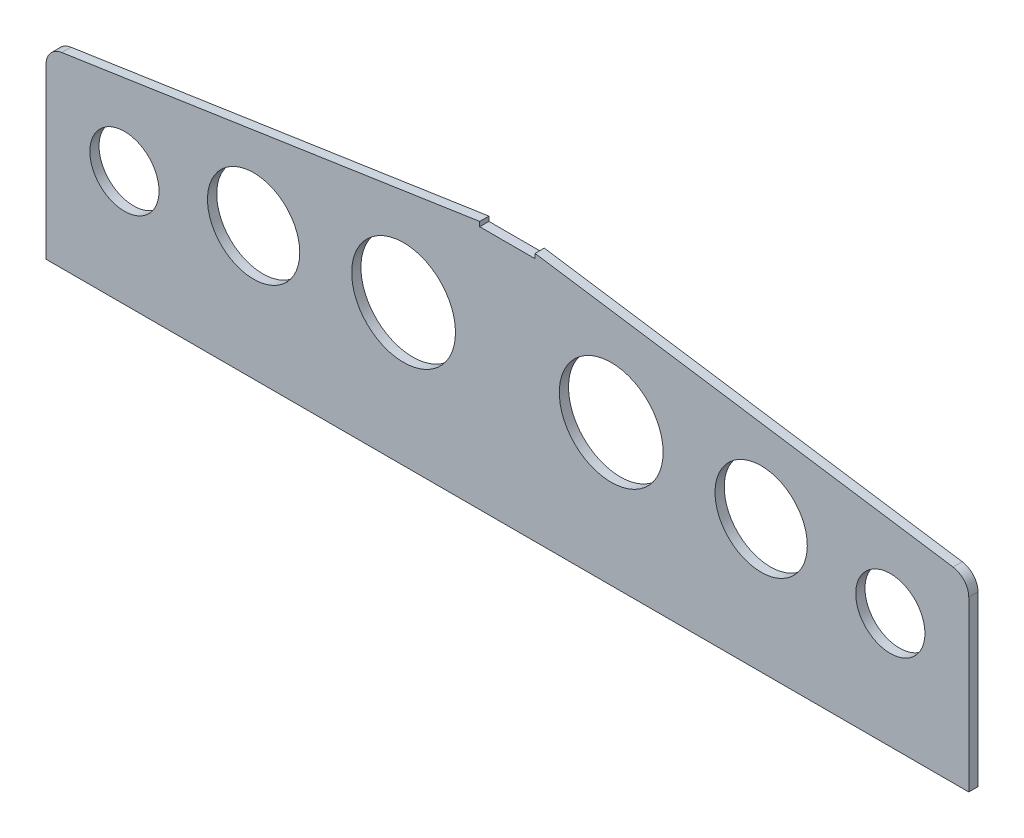
ISO-10303-21;
HEADER;
FILE_DESCRIPTION(('STEP AP214'),'2;1');
FILE_NAME('part.step','',(''),(''),'','','');
FILE_SCHEMA(('AUTOMOTIVE_DESIGN { 1 0 10303 214 1 1 1 1 }'));
ENDSEC;
DATA;
#1=APPLICATION_CONTEXT('core data for automotive mechanical design processes');
#2=APPLICATION_PROTOCOL_DEFINITION('international standard','automotive_design',2000,#1);
#3=PRODUCT_CONTEXT('',#1,'mechanical');
#4=PRODUCT('Part','Part','',(#3));
#5=PRODUCT_RELATED_PRODUCT_CATEGORY('part','',(#4));
#6=PRODUCT_DEFINITION_FORMATION('','',#4);
#7=PRODUCT_DEFINITION_CONTEXT('part definition',#1,'design');
#8=PRODUCT_DEFINITION('design','',#6,#7);
#9=PRODUCT_DEFINITION_SHAPE('','',#8);
#10=(LENGTH_UNIT() NAMED_UNIT(*) SI_UNIT(.MILLI.,.METRE.));
#11=(NAMED_UNIT(*) PLANE_ANGLE_UNIT() SI_UNIT($,.RADIAN.));
#12=(NAMED_UNIT(*) SI_UNIT($,.STERADIAN.) SOLID_ANGLE_UNIT());
#13=UNCERTAINTY_MEASURE_WITH_UNIT(LENGTH_MEASURE(1.E-05),#10,'distance_accuracy_value','');
#14=(GEOMETRIC_REPRESENTATION_CONTEXT(3) GLOBAL_UNCERTAINTY_ASSIGNED_CONTEXT((#13)) GLOBAL_UNIT_ASSIGNED_CONTEXT((#10,
#11,#12)) REPRESENTATION_CONTEXT('',''));
#15=CARTESIAN_POINT('',(0.,0.,0.));
#16=DIRECTION('',(0.,0.,1.));
#17=DIRECTION('',(1.,0.,0.));
#18=AXIS2_PLACEMENT_3D('',#15,#16,#17);
#19=CARTESIAN_POINT('',(-307.638914212905,504.066678813334,4.));
#20=DIRECTION('',(0.,0.,1.));
#21=DIRECTION('',(1.,0.,0.));
#22=AXIS2_PLACEMENT_3D('',#19,#20,#21);
#23=PLANE('',#22);
#24=CARTESIAN_POINT('',(-225.638914212905,488.456178179796,4.));
#25=DIRECTION('',(0.,0.,1.));
#26=DIRECTION('',(1.,0.,0.));
#27=AXIS2_PLACEMENT_3D('',#24,#25,#26);
#28=CIRCLE('',#27,20.);
#29=CARTESIAN_POINT('',(-205.638914212905,488.456178179796,4.));
#30=VERTEX_POINT('',#29);
#31=EDGE_CURVE('E232',#30,#30,#28,.T.);
#32=ORIENTED_EDGE('',*,*,#31,.F.);
#33=EDGE_LOOP('',(#32));
#34=FACE_BOUND('',#33,.T.);
#35=CARTESIAN_POINT('',(-70.6389142129046,492.206178179796,4.));
#36=DIRECTION('',(0.,0.,1.));
#37=DIRECTION('',(1.,0.,0.));
#38=AXIS2_PLACEMENT_3D('',#35,#36,#37);
#39=CIRCLE('',#38,22.5);
#40=CARTESIAN_POINT('',(-48.1389142129046,492.206178179796,4.));
#41=VERTEX_POINT('',#40);
#42=EDGE_CURVE('E220',#41,#41,#39,.T.);
#43=ORIENTED_EDGE('',*,*,#42,.F.);
#44=EDGE_LOOP('',(#43));
#45=FACE_BOUND('',#44,.T.);
#46=CARTESIAN_POINT('',(50.3610857870954,480.956178179796,4.));
#47=DIRECTION('',(0.,0.,1.));
#48=DIRECTION('',(1.,0.,0.));
#49=AXIS2_PLACEMENT_3D('',#46,#47,#48);
#50=CIRCLE('',#49,15.);
#51=CARTESIAN_POINT('',(65.3610857870954,480.956178179796,4.));
#52=VERTEX_POINT('',#51);
#53=EDGE_CURVE('E148',#52,#52,#50,.T.);
#54=ORIENTED_EDGE('',*,*,#53,.F.);
#55=EDGE_LOOP('',(#54));
#56=FACE_BOUND('',#55,.T.);
#57=CARTESIAN_POINT('',(-307.638914212905,504.066678813334,4.));
#58=DIRECTION('',(0.,0.,1.));
#59=DIRECTION('',(1.,0.,0.));
#60=AXIS2_PLACEMENT_3D('',#57,#58,#59);
#61=CIRCLE('',#60,8.00000000000002);
#62=CARTESIAN_POINT('',(-308.825637836347,511.97816963628,4.));
#63=VERTEX_POINT('',#62);
#64=CARTESIAN_POINT('',(-315.638914212905,504.066678813334,4.));
#65=VERTEX_POINT('',#64);
#66=EDGE_CURVE('E163',#63,#65,#61,.T.);
#67=ORIENTED_EDGE('',*,*,#66,.T.);
#68=DIRECTION('',(0.,-1.,0.));
#69=VECTOR('',#68,1.);
#70=CARTESIAN_POINT('',(-315.638914212905,504.066678813334,4.));
#71=LINE('',#70,#69);
#72=CARTESIAN_POINT('',(-315.638914212905,430.956178179796,4.));
#73=VERTEX_POINT('',#72);
#74=EDGE_CURVE('E101',#65,#73,#71,.T.);
#75=ORIENTED_EDGE('',*,*,#74,.T.);
#76=DIRECTION('',(1.,0.,0.));
#77=VECTOR('',#76,1.);
#78=CARTESIAN_POINT('',(-315.638914212905,430.956178179796,4.));
#79=LINE('',#78,#77);
#80=CARTESIAN_POINT('',(84.3610857870955,430.956178179796,4.));
#81=VERTEX_POINT('',#80);
#82=EDGE_CURVE('E184',#73,#81,#79,.T.);
#83=ORIENTED_EDGE('',*,*,#82,.T.);
#84=DIRECTION('',(0.,1.,0.));
#85=VECTOR('',#84,1.);
#86=CARTESIAN_POINT('',(84.3610857870954,504.066678813334,4.));
#87=LINE('',#86,#85);
#88=CARTESIAN_POINT('',(84.3610857870954,504.066678813334,4.));
#89=VERTEX_POINT('',#88);
#90=EDGE_CURVE('E203',#81,#89,#87,.T.);
#91=ORIENTED_EDGE('',*,*,#90,.T.);
#92=CARTESIAN_POINT('',(76.3610857870954,504.066678813334,4.));
#93=DIRECTION('',(0.,0.,1.));
#94=DIRECTION('',(1.,0.,0.));
#95=AXIS2_PLACEMENT_3D('',#92,#93,#94);
#96=CIRCLE('',#95,8.00000000000001);
#97=CARTESIAN_POINT('',(77.5478094105374,511.97816963628,4.));
#98=VERTEX_POINT('',#97);
#99=EDGE_CURVE('E200',#89,#98,#96,.T.);
#100=ORIENTED_EDGE('',*,*,#99,.T.);
#101=DIRECTION('',(-0.988936352868298,0.148340452930244,0.));
#102=VECTOR('',#101,1.);
#103=CARTESIAN_POINT('',(-103.638914212905,539.156178179796,4.));
#104=LINE('',#103,#102);
#105=CARTESIAN_POINT('',(-103.638914212905,539.156178179796,4.));
#106=VERTEX_POINT('',#105);
#107=EDGE_CURVE('E202',#98,#106,#104,.T.);
#108=ORIENTED_EDGE('',*,*,#107,.T.);
#109=DIRECTION('',(0.,-1.,0.));
#110=VECTOR('',#109,1.);
#111=CARTESIAN_POINT('',(-103.638914212905,539.156178179796,4.));
#112=LINE('',#111,#110);
#113=CARTESIAN_POINT('',(-103.638914212905,537.156178179796,4.));
#114=VERTEX_POINT('',#113);
#115=EDGE_CURVE('E126',#106,#114,#112,.T.);
#116=ORIENTED_EDGE('',*,*,#115,.T.);
#117=DIRECTION('',(-1.,0.,0.));
#118=VECTOR('',#117,1.);
#119=CARTESIAN_POINT('',(-127.638914212905,537.156178179796,4.));
#120=LINE('',#119,#118);
#121=CARTESIAN_POINT('',(-127.638914212905,537.156178179796,4.));
#122=VERTEX_POINT('',#121);
#123=EDGE_CURVE('E120',#114,#122,#120,.T.);
#124=ORIENTED_EDGE('',*,*,#123,.T.);
#125=DIRECTION('',(0.,1.,0.));
#126=VECTOR('',#125,1.);
#127=CARTESIAN_POINT('',(-127.638914212905,539.156178179796,4.));
#128=LINE('',#127,#126);
#129=CARTESIAN_POINT('',(-127.638914212905,539.156178179796,4.));
#130=VERTEX_POINT('',#129);
#131=EDGE_CURVE('E124',#122,#130,#128,.T.);
#132=ORIENTED_EDGE('',*,*,#131,.T.);
#133=DIRECTION('',(-0.988936352868298,-0.148340452930244,0.));
#134=VECTOR('',#133,1.);
#135=CARTESIAN_POINT('',(-127.638914212905,539.156178179796,4.));
#136=LINE('',#135,#134);
#137=EDGE_CURVE('E52',#130,#63,#136,.T.);
#138=ORIENTED_EDGE('',*,*,#137,.T.);
#139=EDGE_LOOP('',(#67,#75,#83,#91,#100,#108,#116,#124,#132,#138));
#140=FACE_BOUND('',#139,.T.);
#141=CARTESIAN_POINT('',(-5.63891421290464,488.456178179796,4.));
#142=DIRECTION('',(0.,0.,1.));
#143=DIRECTION('',(1.,0.,0.));
#144=AXIS2_PLACEMENT_3D('',#141,#142,#143);
#145=CIRCLE('',#144,20.);
#146=CARTESIAN_POINT('',(14.3610857870954,488.456178179796,4.));
#147=VERTEX_POINT('',#146);
#148=EDGE_CURVE('E214',#147,#147,#145,.T.);
#149=ORIENTED_EDGE('',*,*,#148,.F.);
#150=EDGE_LOOP('',(#149));
#151=FACE_BOUND('',#150,.T.);
#152=CARTESIAN_POINT('',(-281.638914212905,480.956178179796,4.));
#153=DIRECTION('',(0.,0.,1.));
#154=DIRECTION('',(1.,0.,0.));
#155=AXIS2_PLACEMENT_3D('',#152,#153,#154);
#156=CIRCLE('',#155,15.);
#157=CARTESIAN_POINT('',(-266.638914212905,480.956178179796,4.));
#158=VERTEX_POINT('',#157);
#159=EDGE_CURVE('E226',#158,#158,#156,.T.);
#160=ORIENTED_EDGE('',*,*,#159,.F.);
#161=EDGE_LOOP('',(#160));
#162=FACE_BOUND('',#161,.T.);
#163=CARTESIAN_POINT('',(-160.638914212905,492.206178179796,4.));
#164=DIRECTION('',(0.,0.,1.));
#165=DIRECTION('',(1.,0.,0.));
#166=AXIS2_PLACEMENT_3D('',#163,#164,#165);
#167=CIRCLE('',#166,22.5);
#168=CARTESIAN_POINT('',(-138.138914212905,492.206178179796,4.));
#169=VERTEX_POINT('',#168);
#170=EDGE_CURVE('E238',#169,#169,#167,.T.);
#171=ORIENTED_EDGE('',*,*,#170,.F.);
#172=EDGE_LOOP('',(#171));
#173=FACE_BOUND('',#172,.T.);
#174=ADVANCED_FACE('F35',(#34,#45,#56,#140,#151,#162,#173),#23,.T.);
#175=CARTESIAN_POINT('',(-307.638914212905,504.066678813334,0.));
#176=DIRECTION('',(0.,0.,1.));
#177=DIRECTION('',(1.,0.,0.));
#178=AXIS2_PLACEMENT_3D('',#175,#176,#177);
#179=PLANE('',#178);
#180=CARTESIAN_POINT('',(-307.638914212905,504.066678813334,0.));
#181=DIRECTION('',(0.,0.,1.));
#182=DIRECTION('',(1.,0.,0.));
#183=AXIS2_PLACEMENT_3D('',#180,#181,#182);
#184=CIRCLE('',#183,8.00000000000002);
#185=CARTESIAN_POINT('',(-308.825637836347,511.97816963628,0.));
#186=VERTEX_POINT('',#185);
#187=CARTESIAN_POINT('',(-315.638914212905,504.066678813334,0.));
#188=VERTEX_POINT('',#187);
#189=EDGE_CURVE('E144',#186,#188,#184,.T.);
#190=ORIENTED_EDGE('',*,*,#189,.F.);
#191=DIRECTION('',(-0.988936352868298,-0.148340452930244,0.));
#192=VECTOR('',#191,1.);
#193=CARTESIAN_POINT('',(-127.638914212905,539.156178179796,0.));
#194=LINE('',#193,#192);
#195=CARTESIAN_POINT('',(-127.638914212905,539.156178179796,0.));
#196=VERTEX_POINT('',#195);
#197=EDGE_CURVE('E93',#196,#186,#194,.T.);
#198=ORIENTED_EDGE('',*,*,#197,.F.);
#199=DIRECTION('',(0.,1.,0.));
#200=VECTOR('',#199,1.);
#201=CARTESIAN_POINT('',(-127.638914212905,539.156178179796,0.));
#202=LINE('',#201,#200);
#203=CARTESIAN_POINT('',(-127.638914212905,537.156178179796,0.));
#204=VERTEX_POINT('',#203);
#205=EDGE_CURVE('E87',#204,#196,#202,.T.);
#206=ORIENTED_EDGE('',*,*,#205,.F.);
#207=DIRECTION('',(-1.,0.,0.));
#208=VECTOR('',#207,1.);
#209=CARTESIAN_POINT('',(-127.638914212905,537.156178179796,0.));
#210=LINE('',#209,#208);
#211=CARTESIAN_POINT('',(-103.638914212905,537.156178179796,0.));
#212=VERTEX_POINT('',#211);
#213=EDGE_CURVE('E134',#212,#204,#210,.T.);
#214=ORIENTED_EDGE('',*,*,#213,.F.);
#215=DIRECTION('',(0.,-1.,0.));
#216=VECTOR('',#215,1.);
#217=CARTESIAN_POINT('',(-103.638914212905,539.156178179796,0.));
#218=LINE('',#217,#216);
#219=CARTESIAN_POINT('',(-103.638914212905,539.156178179796,0.));
#220=VERTEX_POINT('',#219);
#221=EDGE_CURVE('E158',#220,#212,#218,.T.);
#222=ORIENTED_EDGE('',*,*,#221,.F.);
#223=DIRECTION('',(-0.988936352868298,0.148340452930244,0.));
#224=VECTOR('',#223,1.);
#225=CARTESIAN_POINT('',(-103.638914212905,539.156178179796,0.));
#226=LINE('',#225,#224);
#227=CARTESIAN_POINT('',(77.5478094105374,511.97816963628,0.));
#228=VERTEX_POINT('',#227);
#229=EDGE_CURVE('E156',#228,#220,#226,.T.);
#230=ORIENTED_EDGE('',*,*,#229,.F.);
#231=CARTESIAN_POINT('',(76.3610857870954,504.066678813334,0.));
#232=DIRECTION('',(0.,0.,1.));
#233=DIRECTION('',(1.,0.,0.));
#234=AXIS2_PLACEMENT_3D('',#231,#232,#233);
#235=CIRCLE('',#234,8.00000000000001);
#236=CARTESIAN_POINT('',(84.3610857870954,504.066678813334,0.));
#237=VERTEX_POINT('',#236);
#238=EDGE_CURVE('E154',#237,#228,#235,.T.);
#239=ORIENTED_EDGE('',*,*,#238,.F.);
#240=DIRECTION('',(0.,1.,0.));
#241=VECTOR('',#240,1.);
#242=CARTESIAN_POINT('',(84.3610857870954,504.066678813334,0.));
#243=LINE('',#242,#241);
#244=CARTESIAN_POINT('',(84.3610857870955,430.956178179796,0.));
#245=VERTEX_POINT('',#244);
#246=EDGE_CURVE('E152',#245,#237,#243,.T.);
#247=ORIENTED_EDGE('',*,*,#246,.F.);
#248=DIRECTION('',(1.,0.,0.));
#249=VECTOR('',#248,1.);
#250=CARTESIAN_POINT('',(-315.638914212905,430.956178179796,0.));
#251=LINE('',#250,#249);
#252=CARTESIAN_POINT('',(-315.638914212905,430.956178179796,0.));
#253=VERTEX_POINT('',#252);
#254=EDGE_CURVE('E150',#253,#245,#251,.T.);
#255=ORIENTED_EDGE('',*,*,#254,.F.);
#256=DIRECTION('',(0.,-1.,0.));
#257=VECTOR('',#256,1.);
#258=CARTESIAN_POINT('',(-315.638914212905,504.066678813334,0.));
#259=LINE('',#258,#257);
#260=EDGE_CURVE('E147',#188,#253,#259,.T.);
#261=ORIENTED_EDGE('',*,*,#260,.F.);
#262=EDGE_LOOP('',(#190,#198,#206,#214,#222,#230,#239,#247,#255,#261));
#263=FACE_BOUND('',#262,.T.);
#264=CARTESIAN_POINT('',(50.3610857870954,480.956178179796,0.));
#265=DIRECTION('',(0.,0.,1.));
#266=DIRECTION('',(1.,0.,0.));
#267=AXIS2_PLACEMENT_3D('',#264,#265,#266);
#268=CIRCLE('',#267,15.);
#269=CARTESIAN_POINT('',(65.3610857870954,480.956178179796,0.));
#270=VERTEX_POINT('',#269);
#271=EDGE_CURVE('E211',#270,#270,#268,.T.);
#272=ORIENTED_EDGE('',*,*,#271,.T.);
#273=EDGE_LOOP('',(#272));
#274=FACE_BOUND('',#273,.T.);
#275=CARTESIAN_POINT('',(-5.63891421290464,488.456178179796,0.));
#276=DIRECTION('',(0.,0.,1.));
#277=DIRECTION('',(1.,0.,0.));
#278=AXIS2_PLACEMENT_3D('',#275,#276,#277);
#279=CIRCLE('',#278,20.);
#280=CARTESIAN_POINT('',(14.3610857870954,488.456178179796,0.));
#281=VERTEX_POINT('',#280);
#282=EDGE_CURVE('E217',#281,#281,#279,.T.);
#283=ORIENTED_EDGE('',*,*,#282,.T.);
#284=EDGE_LOOP('',(#283));
#285=FACE_BOUND('',#284,.T.);
#286=CARTESIAN_POINT('',(-70.6389142129046,492.206178179796,0.));
#287=DIRECTION('',(0.,0.,1.));
#288=DIRECTION('',(1.,0.,0.));
#289=AXIS2_PLACEMENT_3D('',#286,#287,#288);
#290=CIRCLE('',#289,22.5);
#291=CARTESIAN_POINT('',(-48.1389142129046,492.206178179796,0.));
#292=VERTEX_POINT('',#291);
#293=EDGE_CURVE('E223',#292,#292,#290,.T.);
#294=ORIENTED_EDGE('',*,*,#293,.T.);
#295=EDGE_LOOP('',(#294));
#296=FACE_BOUND('',#295,.T.);
#297=CARTESIAN_POINT('',(-281.638914212905,480.956178179796,0.));
#298=DIRECTION('',(0.,0.,1.));
#299=DIRECTION('',(1.,0.,0.));
#300=AXIS2_PLACEMENT_3D('',#297,#298,#299);
#301=CIRCLE('',#300,15.);
#302=CARTESIAN_POINT('',(-266.638914212905,480.956178179796,0.));
#303=VERTEX_POINT('',#302);
#304=EDGE_CURVE('E229',#303,#303,#301,.T.);
#305=ORIENTED_EDGE('',*,*,#304,.T.);
#306=EDGE_LOOP('',(#305));
#307=FACE_BOUND('',#306,.T.);
#308=CARTESIAN_POINT('',(-225.638914212905,488.456178179796,0.));
#309=DIRECTION('',(0.,0.,1.));
#310=DIRECTION('',(1.,0.,0.));
#311=AXIS2_PLACEMENT_3D('',#308,#309,#310);
#312=CIRCLE('',#311,20.);
#313=CARTESIAN_POINT('',(-205.638914212905,488.456178179796,0.));
#314=VERTEX_POINT('',#313);
#315=EDGE_CURVE('E235',#314,#314,#312,.T.);
#316=ORIENTED_EDGE('',*,*,#315,.T.);
#317=EDGE_LOOP('',(#316));
#318=FACE_BOUND('',#317,.T.);
#319=CARTESIAN_POINT('',(-160.638914212905,492.206178179796,0.));
#320=DIRECTION('',(0.,0.,1.));
#321=DIRECTION('',(1.,0.,0.));
#322=AXIS2_PLACEMENT_3D('',#319,#320,#321);
#323=CIRCLE('',#322,22.5);
#324=CARTESIAN_POINT('',(-138.138914212905,492.206178179796,0.));
#325=VERTEX_POINT('',#324);
#326=EDGE_CURVE('E241',#325,#325,#323,.T.);
#327=ORIENTED_EDGE('',*,*,#326,.T.);
#328=EDGE_LOOP('',(#327));
#329=FACE_BOUND('',#328,.T.);
#330=ADVANCED_FACE('F188',(#263,#274,#285,#296,#307,#318,#329),#179,.F.);
#331=CARTESIAN_POINT('',(-307.638914212905,504.066678813334,4.));
#332=DIRECTION('',(0.,0.,-1.));
#333=DIRECTION('',(-1.,0.,0.));
#334=AXIS2_PLACEMENT_3D('',#331,#332,#333);
#335=CYLINDRICAL_SURFACE('',#334,8.00000000000002);
#336=ORIENTED_EDGE('',*,*,#189,.T.);
#337=DIRECTION('',(0.,0.,-1.));
#338=VECTOR('',#337,1.);
#339=CARTESIAN_POINT('',(-315.638914212905,504.066678813334,4.));
#340=LINE('',#339,#338);
#341=EDGE_CURVE('E11',#65,#188,#340,.T.);
#342=ORIENTED_EDGE('',*,*,#341,.F.);
#343=ORIENTED_EDGE('',*,*,#66,.F.);
#344=DIRECTION('',(0.,0.,-1.));
#345=VECTOR('',#344,1.);
#346=CARTESIAN_POINT('',(-308.825637836347,511.97816963628,4.));
#347=LINE('',#346,#345);
#348=EDGE_CURVE('E140',#63,#186,#347,.T.);
#349=ORIENTED_EDGE('',*,*,#348,.T.);
#350=EDGE_LOOP('',(#336,#342,#343,#349));
#351=FACE_BOUND('',#350,.T.);
#352=ADVANCED_FACE('F37',(#351),#335,.T.);
#353=CARTESIAN_POINT('',(-315.638914212905,504.066678813334,4.));
#354=DIRECTION('',(1.,0.,0.));
#355=DIRECTION('',(0.,1.,0.));
#356=AXIS2_PLACEMENT_3D('',#353,#354,#355);
#357=PLANE('',#356);
#358=ORIENTED_EDGE('',*,*,#260,.T.);
#359=DIRECTION('',(0.,0.,-1.));
#360=VECTOR('',#359,1.);
#361=CARTESIAN_POINT('',(-315.638914212905,430.956178179796,4.));
#362=LINE('',#361,#360);
#363=EDGE_CURVE('E44',#73,#253,#362,.T.);
#364=ORIENTED_EDGE('',*,*,#363,.F.);
#365=ORIENTED_EDGE('',*,*,#74,.F.);
#366=ORIENTED_EDGE('',*,*,#341,.T.);
#367=EDGE_LOOP('',(#358,#364,#365,#366));
#368=FACE_BOUND('',#367,.T.);
#369=ADVANCED_FACE('F283',(#368),#357,.F.);
#370=CARTESIAN_POINT('',(-315.638914212905,430.956178179796,4.));
#371=DIRECTION('',(0.,1.,0.));
#372=DIRECTION('',(0.,0.,1.));
#373=AXIS2_PLACEMENT_3D('',#370,#371,#372);
#374=PLANE('',#373);
#375=ORIENTED_EDGE('',*,*,#254,.T.);
#376=DIRECTION('',(0.,0.,-1.));
#377=VECTOR('',#376,1.);
#378=CARTESIAN_POINT('',(84.3610857870955,430.956178179796,4.));
#379=LINE('',#378,#377);
#380=EDGE_CURVE('E176',#81,#245,#379,.T.);
#381=ORIENTED_EDGE('',*,*,#380,.F.);
#382=ORIENTED_EDGE('',*,*,#82,.F.);
#383=ORIENTED_EDGE('',*,*,#363,.T.);
#384=EDGE_LOOP('',(#375,#381,#382,#383));
#385=FACE_BOUND('',#384,.T.);
#386=ADVANCED_FACE('F182',(#385),#374,.F.);
#387=CARTESIAN_POINT('',(84.3610857870954,504.066678813334,4.));
#388=DIRECTION('',(-1.,0.,0.));
#389=DIRECTION('',(0.,-1.,0.));
#390=AXIS2_PLACEMENT_3D('',#387,#388,#389);
#391=PLANE('',#390);
#392=ORIENTED_EDGE('',*,*,#246,.T.);
#393=DIRECTION('',(0.,0.,-1.));
#394=VECTOR('',#393,1.);
#395=CARTESIAN_POINT('',(84.3610857870954,504.066678813334,4.));
#396=LINE('',#395,#394);
#397=EDGE_CURVE('E173',#89,#237,#396,.T.);
#398=ORIENTED_EDGE('',*,*,#397,.F.);
#399=ORIENTED_EDGE('',*,*,#90,.F.);
#400=ORIENTED_EDGE('',*,*,#380,.T.);
#401=EDGE_LOOP('',(#392,#398,#399,#400));
#402=FACE_BOUND('',#401,.T.);
#403=ADVANCED_FACE('F194',(#402),#391,.F.);
#404=CARTESIAN_POINT('',(76.3610857870954,504.066678813334,4.));
#405=DIRECTION('',(0.,0.,-1.));
#406=DIRECTION('',(-1.,0.,0.));
#407=AXIS2_PLACEMENT_3D('',#404,#405,#406);
#408=CYLINDRICAL_SURFACE('',#407,8.00000000000001);
#409=ORIENTED_EDGE('',*,*,#238,.T.);
#410=DIRECTION('',(0.,0.,-1.));
#411=VECTOR('',#410,1.);
#412=CARTESIAN_POINT('',(77.5478094105374,511.97816963628,4.));
#413=LINE('',#412,#411);
#414=EDGE_CURVE('E170',#98,#228,#413,.T.);
#415=ORIENTED_EDGE('',*,*,#414,.F.);
#416=ORIENTED_EDGE('',*,*,#99,.F.);
#417=ORIENTED_EDGE('',*,*,#397,.T.);
#418=EDGE_LOOP('',(#409,#415,#416,#417));
#419=FACE_BOUND('',#418,.T.);
#420=ADVANCED_FACE('F198',(#419),#408,.T.);
#421=CARTESIAN_POINT('',(-103.638914212905,539.156178179796,4.));
#422=DIRECTION('',(-0.148340452930244,-0.988936352868298,0.));
#423=DIRECTION('',(0.988936352868298,-0.148340452930244,0.));
#424=AXIS2_PLACEMENT_3D('',#421,#422,#423);
#425=PLANE('',#424);
#426=ORIENTED_EDGE('',*,*,#229,.T.);
#427=DIRECTION('',(0.,0.,-1.));
#428=VECTOR('',#427,1.);
#429=CARTESIAN_POINT('',(-103.638914212905,539.156178179796,4.));
#430=LINE('',#429,#428);
#431=EDGE_CURVE('E167',#106,#220,#430,.T.);
#432=ORIENTED_EDGE('',*,*,#431,.F.);
#433=ORIENTED_EDGE('',*,*,#107,.F.);
#434=ORIENTED_EDGE('',*,*,#414,.T.);
#435=EDGE_LOOP('',(#426,#432,#433,#434));
#436=FACE_BOUND('',#435,.T.);
#437=ADVANCED_FACE('F273',(#436),#425,.F.);
#438=CARTESIAN_POINT('',(-103.638914212905,539.156178179796,4.));
#439=DIRECTION('',(1.,0.,0.));
#440=DIRECTION('',(0.,0.,-1.));
#441=AXIS2_PLACEMENT_3D('',#438,#439,#440);
#442=PLANE('',#441);
#443=ORIENTED_EDGE('',*,*,#221,.T.);
#444=DIRECTION('',(0.,0.,-1.));
#445=VECTOR('',#444,1.);
#446=CARTESIAN_POINT('',(-103.638914212905,537.156178179796,4.));
#447=LINE('',#446,#445);
#448=EDGE_CURVE('E135',#114,#212,#447,.T.);
#449=ORIENTED_EDGE('',*,*,#448,.F.);
#450=ORIENTED_EDGE('',*,*,#115,.F.);
#451=ORIENTED_EDGE('',*,*,#431,.T.);
#452=EDGE_LOOP('',(#443,#449,#450,#451));
#453=FACE_BOUND('',#452,.T.);
#454=ADVANCED_FACE('F270',(#453),#442,.F.);
#455=CARTESIAN_POINT('',(-127.638914212905,537.156178179796,4.));
#456=DIRECTION('',(0.,-1.,0.));
#457=DIRECTION('',(0.,0.,-1.));
#458=AXIS2_PLACEMENT_3D('',#455,#456,#457);
#459=PLANE('',#458);
#460=ORIENTED_EDGE('',*,*,#213,.T.);
#461=DIRECTION('',(0.,0.,-1.));
#462=VECTOR('',#461,1.);
#463=CARTESIAN_POINT('',(-127.638914212905,537.156178179796,4.));
#464=LINE('',#463,#462);
#465=EDGE_CURVE('E131',#122,#204,#464,.T.);
#466=ORIENTED_EDGE('',*,*,#465,.F.);
#467=ORIENTED_EDGE('',*,*,#123,.F.);
#468=ORIENTED_EDGE('',*,*,#448,.T.);
#469=EDGE_LOOP('',(#460,#466,#467,#468));
#470=FACE_BOUND('',#469,.T.);
#471=ADVANCED_FACE('F132',(#470),#459,.F.);
#472=CARTESIAN_POINT('',(-127.638914212905,539.156178179796,4.));
#473=DIRECTION('',(-1.,0.,0.));
#474=DIRECTION('',(0.,-1.,0.));
#475=AXIS2_PLACEMENT_3D('',#472,#473,#474);
#476=PLANE('',#475);
#477=ORIENTED_EDGE('',*,*,#205,.T.);
#478=DIRECTION('',(0.,0.,-1.));
#479=VECTOR('',#478,1.);
#480=CARTESIAN_POINT('',(-127.638914212905,539.156178179796,4.));
#481=LINE('',#480,#479);
#482=EDGE_CURVE('E136',#130,#196,#481,.T.);
#483=ORIENTED_EDGE('',*,*,#482,.F.);
#484=ORIENTED_EDGE('',*,*,#131,.F.);
#485=ORIENTED_EDGE('',*,*,#465,.T.);
#486=EDGE_LOOP('',(#477,#483,#484,#485));
#487=FACE_BOUND('',#486,.T.);
#488=ADVANCED_FACE('F138',(#487),#476,.F.);
#489=CARTESIAN_POINT('',(-127.638914212905,539.156178179796,4.));
#490=DIRECTION('',(0.148340452930244,-0.988936352868298,0.));
#491=DIRECTION('',(0.988936352868298,0.148340452930244,0.));
#492=AXIS2_PLACEMENT_3D('',#489,#490,#491);
#493=PLANE('',#492);
#494=ORIENTED_EDGE('',*,*,#197,.T.);
#495=ORIENTED_EDGE('',*,*,#348,.F.);
#496=ORIENTED_EDGE('',*,*,#137,.F.);
#497=ORIENTED_EDGE('',*,*,#482,.T.);
#498=EDGE_LOOP('',(#494,#495,#496,#497));
#499=FACE_BOUND('',#498,.T.);
#500=ADVANCED_FACE('F263',(#499),#493,.F.);
#501=CARTESIAN_POINT('',(50.3610857870954,480.956178179796,4.));
#502=DIRECTION('',(0.,0.,-1.));
#503=DIRECTION('',(-1.,0.,0.));
#504=AXIS2_PLACEMENT_3D('',#501,#502,#503);
#505=CYLINDRICAL_SURFACE('',#504,15.);
#506=ORIENTED_EDGE('',*,*,#53,.T.);
#507=EDGE_LOOP('',(#506));
#508=FACE_BOUND('',#507,.T.);
#509=ORIENTED_EDGE('',*,*,#271,.F.);
#510=EDGE_LOOP('',(#509));
#511=FACE_BOUND('',#510,.T.);
#512=ADVANCED_FACE('F260',(#508,#511),#505,.F.);
#513=CARTESIAN_POINT('',(-5.63891421290464,488.456178179796,4.));
#514=DIRECTION('',(0.,0.,-1.));
#515=DIRECTION('',(-1.,0.,0.));
#516=AXIS2_PLACEMENT_3D('',#513,#514,#515);
#517=CYLINDRICAL_SURFACE('',#516,20.);
#518=ORIENTED_EDGE('',*,*,#148,.T.);
#519=EDGE_LOOP('',(#518));
#520=FACE_BOUND('',#519,.T.);
#521=ORIENTED_EDGE('',*,*,#282,.F.);
#522=EDGE_LOOP('',(#521));
#523=FACE_BOUND('',#522,.T.);
#524=ADVANCED_FACE('F359',(#520,#523),#517,.F.);
#525=CARTESIAN_POINT('',(-70.6389142129046,492.206178179796,4.));
#526=DIRECTION('',(0.,0.,-1.));
#527=DIRECTION('',(-1.,0.,0.));
#528=AXIS2_PLACEMENT_3D('',#525,#526,#527);
#529=CYLINDRICAL_SURFACE('',#528,22.5);
#530=ORIENTED_EDGE('',*,*,#42,.T.);
#531=EDGE_LOOP('',(#530));
#532=FACE_BOUND('',#531,.T.);
#533=ORIENTED_EDGE('',*,*,#293,.F.);
#534=EDGE_LOOP('',(#533));
#535=FACE_BOUND('',#534,.T.);
#536=ADVANCED_FACE('F367',(#532,#535),#529,.F.);
#537=CARTESIAN_POINT('',(-281.638914212905,480.956178179796,4.));
#538=DIRECTION('',(0.,0.,-1.));
#539=DIRECTION('',(-1.,0.,0.));
#540=AXIS2_PLACEMENT_3D('',#537,#538,#539);
#541=CYLINDRICAL_SURFACE('',#540,15.);
#542=ORIENTED_EDGE('',*,*,#159,.T.);
#543=EDGE_LOOP('',(#542));
#544=FACE_BOUND('',#543,.T.);
#545=ORIENTED_EDGE('',*,*,#304,.F.);
#546=EDGE_LOOP('',(#545));
#547=FACE_BOUND('',#546,.T.);
#548=ADVANCED_FACE('F375',(#544,#547),#541,.F.);
#549=CARTESIAN_POINT('',(-225.638914212905,488.456178179796,4.));
#550=DIRECTION('',(0.,0.,-1.));
#551=DIRECTION('',(-1.,0.,0.));
#552=AXIS2_PLACEMENT_3D('',#549,#550,#551);
#553=CYLINDRICAL_SURFACE('',#552,20.);
#554=ORIENTED_EDGE('',*,*,#31,.T.);
#555=EDGE_LOOP('',(#554));
#556=FACE_BOUND('',#555,.T.);
#557=ORIENTED_EDGE('',*,*,#315,.F.);
#558=EDGE_LOOP('',(#557));
#559=FACE_BOUND('',#558,.T.);
#560=ADVANCED_FACE('F384',(#556,#559),#553,.F.);
#561=CARTESIAN_POINT('',(-160.638914212905,492.206178179796,4.));
#562=DIRECTION('',(0.,0.,-1.));
#563=DIRECTION('',(-1.,0.,0.));
#564=AXIS2_PLACEMENT_3D('',#561,#562,#563);
#565=CYLINDRICAL_SURFACE('',#564,22.5);
#566=ORIENTED_EDGE('',*,*,#170,.T.);
#567=EDGE_LOOP('',(#566));
#568=FACE_BOUND('',#567,.T.);
#569=ORIENTED_EDGE('',*,*,#326,.F.);
#570=EDGE_LOOP('',(#569));
#571=FACE_BOUND('',#570,.T.);
#572=ADVANCED_FACE('F247',(#568,#571),#565,.F.);
#573=CLOSED_SHELL('',(#174,#330,#352,#369,#386,#403,#420,#437,#454,#471,#488,#500,#512,#524,
#536,#548,#560,#572));
#574=MANIFOLD_SOLID_BREP('B2',#573);
#575=ADVANCED_BREP_SHAPE_REPRESENTATION('',(#18,#574),#14);
#576=SHAPE_DEFINITION_REPRESENTATION(#9,#575);
ENDSEC;
END-ISO-10303-21;
